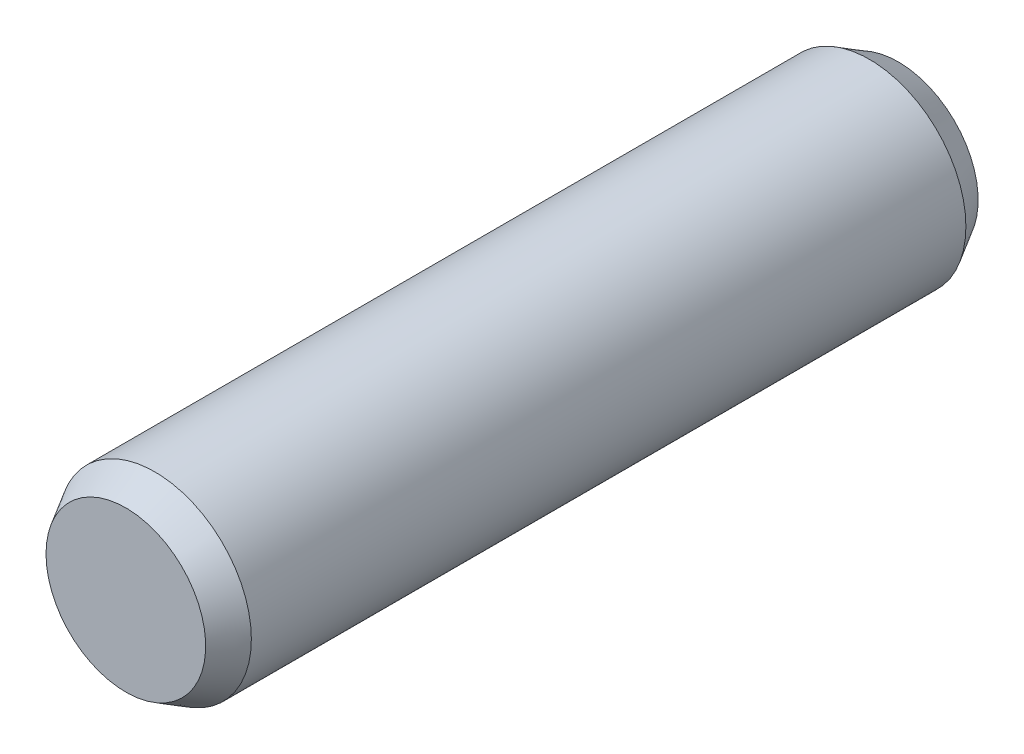
ISO-10303-21;
HEADER;
FILE_DESCRIPTION(('STEP AP214'),'2;1');
FILE_NAME('part.step','',(''),(''),'','','');
FILE_SCHEMA(('AUTOMOTIVE_DESIGN { 1 0 10303 214 1 1 1 1 }'));
ENDSEC;
DATA;
#1=APPLICATION_CONTEXT('core data for automotive mechanical design processes');
#2=APPLICATION_PROTOCOL_DEFINITION('international standard','automotive_design',2000,#1);
#3=PRODUCT_CONTEXT('',#1,'mechanical');
#4=PRODUCT('Part','Part','',(#3));
#5=PRODUCT_RELATED_PRODUCT_CATEGORY('part','',(#4));
#6=PRODUCT_DEFINITION_FORMATION('','',#4);
#7=PRODUCT_DEFINITION_CONTEXT('part definition',#1,'design');
#8=PRODUCT_DEFINITION('design','',#6,#7);
#9=PRODUCT_DEFINITION_SHAPE('','',#8);
#10=(LENGTH_UNIT() NAMED_UNIT(*) SI_UNIT(.MILLI.,.METRE.));
#11=(NAMED_UNIT(*) PLANE_ANGLE_UNIT() SI_UNIT($,.RADIAN.));
#12=(NAMED_UNIT(*) SI_UNIT($,.STERADIAN.) SOLID_ANGLE_UNIT());
#13=UNCERTAINTY_MEASURE_WITH_UNIT(LENGTH_MEASURE(1.E-05),#10,'distance_accuracy_value','');
#14=(GEOMETRIC_REPRESENTATION_CONTEXT(3) GLOBAL_UNCERTAINTY_ASSIGNED_CONTEXT((#13)) GLOBAL_UNIT_ASSIGNED_CONTEXT((#10,
#11,#12)) REPRESENTATION_CONTEXT('',''));
#15=CARTESIAN_POINT('',(0.,0.,0.));
#16=DIRECTION('',(0.,0.,1.));
#17=DIRECTION('',(1.,0.,0.));
#18=AXIS2_PLACEMENT_3D('',#15,#16,#17);
#19=CARTESIAN_POINT('',(0.,0.,37.));
#20=DIRECTION('',(0.,0.,-1.));
#21=DIRECTION('',(-1.,0.,0.));
#22=AXIS2_PLACEMENT_3D('',#19,#20,#21);
#23=CONICAL_SURFACE('',#22,9.99999999999999,0.523598775598294);
#24=CARTESIAN_POINT('',(0.,0.,40.));
#25=DIRECTION('',(0.,0.,-1.));
#26=DIRECTION('',(-1.,0.,0.));
#27=AXIS2_PLACEMENT_3D('',#24,#25,#26);
#28=CIRCLE('',#27,8.26794919243113);
#29=CARTESIAN_POINT('',(-8.26794919243113,0.,40.));
#30=VERTEX_POINT('',#29);
#31=EDGE_CURVE('E47',#30,#30,#28,.T.);
#32=ORIENTED_EDGE('',*,*,#31,.T.);
#33=EDGE_LOOP('',(#32));
#34=FACE_BOUND('',#33,.T.);
#35=CARTESIAN_POINT('',(0.,0.,37.));
#36=DIRECTION('',(0.,0.,-1.));
#37=DIRECTION('',(-1.,0.,0.));
#38=AXIS2_PLACEMENT_3D('',#35,#36,#37);
#39=CIRCLE('',#38,9.99999999999999);
#40=CARTESIAN_POINT('',(-9.99999999999999,0.,37.));
#41=VERTEX_POINT('',#40);
#42=EDGE_CURVE('E10',#41,#41,#39,.T.);
#43=ORIENTED_EDGE('',*,*,#42,.F.);
#44=EDGE_LOOP('',(#43));
#45=FACE_BOUND('',#44,.T.);
#46=ADVANCED_FACE('F33',(#34,#45),#23,.T.);
#47=CARTESIAN_POINT('',(0.,0.,-40.));
#48=DIRECTION('',(0.,0.,-1.));
#49=DIRECTION('',(-1.,0.,0.));
#50=AXIS2_PLACEMENT_3D('',#47,#48,#49);
#51=CYLINDRICAL_SURFACE('',#50,10.);
#52=ORIENTED_EDGE('',*,*,#42,.T.);
#53=EDGE_LOOP('',(#52));
#54=FACE_BOUND('',#53,.T.);
#55=CARTESIAN_POINT('',(0.,0.,-37.));
#56=DIRECTION('',(0.,0.,-1.));
#57=DIRECTION('',(-1.,0.,0.));
#58=AXIS2_PLACEMENT_3D('',#55,#56,#57);
#59=CIRCLE('',#58,10.);
#60=CARTESIAN_POINT('',(-10.,0.,-37.));
#61=VERTEX_POINT('',#60);
#62=EDGE_CURVE('E39',#61,#61,#59,.T.);
#63=ORIENTED_EDGE('',*,*,#62,.F.);
#64=EDGE_LOOP('',(#63));
#65=FACE_BOUND('',#64,.T.);
#66=ADVANCED_FACE('F66',(#54,#65),#51,.T.);
#67=CARTESIAN_POINT('',(0.,0.,-40.));
#68=DIRECTION('',(0.,0.,1.));
#69=DIRECTION('',(1.,0.,0.));
#70=AXIS2_PLACEMENT_3D('',#67,#68,#69);
#71=CONICAL_SURFACE('',#70,8.26794919243114,0.523598775598295);
#72=ORIENTED_EDGE('',*,*,#62,.T.);
#73=EDGE_LOOP('',(#72));
#74=FACE_BOUND('',#73,.T.);
#75=CARTESIAN_POINT('',(0.,0.,-40.));
#76=DIRECTION('',(0.,0.,-1.));
#77=DIRECTION('',(-1.,0.,0.));
#78=AXIS2_PLACEMENT_3D('',#75,#76,#77);
#79=CIRCLE('',#78,8.26794919243114);
#80=CARTESIAN_POINT('',(-8.26794919243114,0.,-40.));
#81=VERTEX_POINT('',#80);
#82=EDGE_CURVE('E43',#81,#81,#79,.T.);
#83=ORIENTED_EDGE('',*,*,#82,.F.);
#84=EDGE_LOOP('',(#83));
#85=FACE_BOUND('',#84,.T.);
#86=ADVANCED_FACE('F62',(#74,#85),#71,.T.);
#87=CARTESIAN_POINT('',(0.,8.26794919243114,-40.));
#88=DIRECTION('',(0.,0.,-1.));
#89=DIRECTION('',(-1.,0.,0.));
#90=AXIS2_PLACEMENT_3D('',#87,#88,#89);
#91=PLANE('',#90);
#92=ORIENTED_EDGE('',*,*,#82,.T.);
#93=EDGE_LOOP('',(#92));
#94=FACE_BOUND('',#93,.T.);
#95=ADVANCED_FACE('F57',(#94),#91,.T.);
#96=CARTESIAN_POINT('',(0.,0.,40.));
#97=DIRECTION('',(0.,0.,1.));
#98=DIRECTION('',(1.,0.,0.));
#99=AXIS2_PLACEMENT_3D('',#96,#97,#98);
#100=PLANE('',#99);
#101=ORIENTED_EDGE('',*,*,#31,.F.);
#102=EDGE_LOOP('',(#101));
#103=FACE_BOUND('',#102,.T.);
#104=ADVANCED_FACE('F55',(#103),#100,.T.);
#105=CLOSED_SHELL('',(#46,#66,#86,#95,#104));
#106=MANIFOLD_SOLID_BREP('B2',#105);
#107=ADVANCED_BREP_SHAPE_REPRESENTATION('',(#18,#106),#14);
#108=SHAPE_DEFINITION_REPRESENTATION(#9,#107);
ENDSEC;
END-ISO-10303-21;
